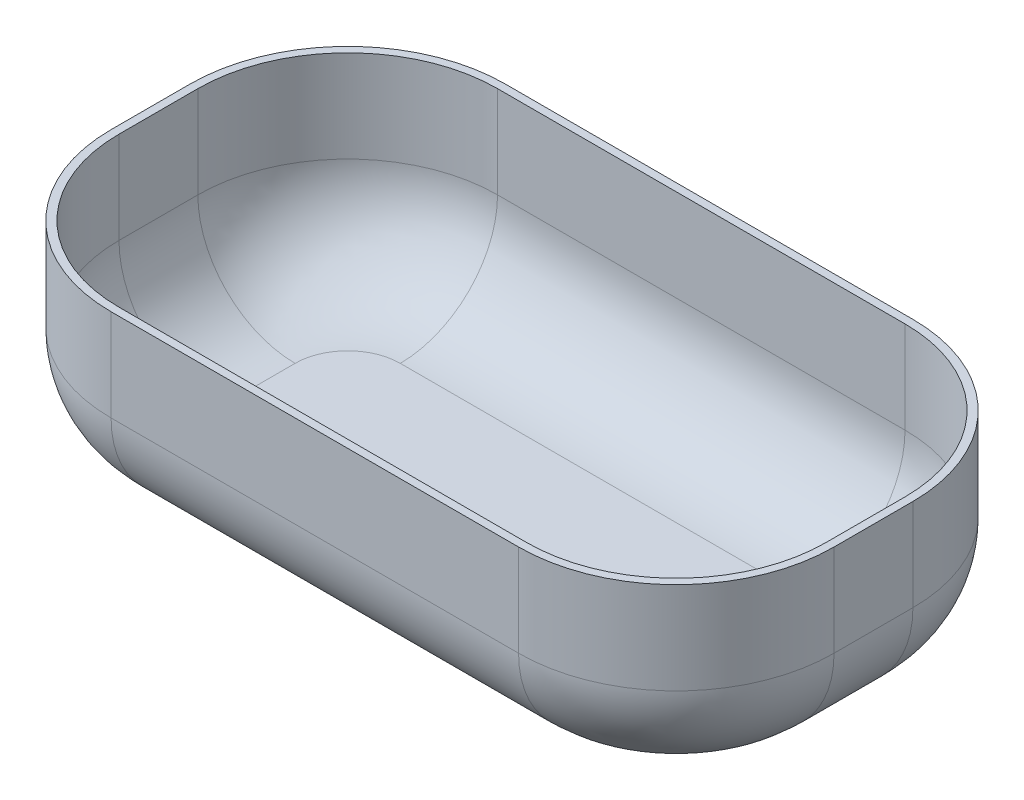
ISO-10303-21;
HEADER;
FILE_DESCRIPTION(('STEP AP214'),'2;1');
FILE_NAME('part.step','',(''),(''),'','','');
FILE_SCHEMA(('AUTOMOTIVE_DESIGN { 1 0 10303 214 1 1 1 1 }'));
ENDSEC;
DATA;
#1=APPLICATION_CONTEXT('core data for automotive mechanical design processes');
#2=APPLICATION_PROTOCOL_DEFINITION('international standard','automotive_design',2000,#1);
#3=PRODUCT_CONTEXT('',#1,'mechanical');
#4=PRODUCT('Part','Part','',(#3));
#5=PRODUCT_RELATED_PRODUCT_CATEGORY('part','',(#4));
#6=PRODUCT_DEFINITION_FORMATION('','',#4);
#7=PRODUCT_DEFINITION_CONTEXT('part definition',#1,'design');
#8=PRODUCT_DEFINITION('design','',#6,#7);
#9=PRODUCT_DEFINITION_SHAPE('','',#8);
#10=(LENGTH_UNIT() NAMED_UNIT(*) SI_UNIT(.MILLI.,.METRE.));
#11=(NAMED_UNIT(*) PLANE_ANGLE_UNIT() SI_UNIT($,.RADIAN.));
#12=(NAMED_UNIT(*) SI_UNIT($,.STERADIAN.) SOLID_ANGLE_UNIT());
#13=UNCERTAINTY_MEASURE_WITH_UNIT(LENGTH_MEASURE(1.E-05),#10,'distance_accuracy_value','');
#14=(GEOMETRIC_REPRESENTATION_CONTEXT(3) GLOBAL_UNCERTAINTY_ASSIGNED_CONTEXT((#13)) GLOBAL_UNIT_ASSIGNED_CONTEXT((#10,
#11,#12)) REPRESENTATION_CONTEXT('',''));
#15=CARTESIAN_POINT('',(0.,0.,0.));
#16=DIRECTION('',(0.,0.,1.));
#17=DIRECTION('',(1.,0.,0.));
#18=AXIS2_PLACEMENT_3D('',#15,#16,#17);
#19=CARTESIAN_POINT('',(-275.,0.,150.));
#20=DIRECTION('',(1.,0.,0.));
#21=DIRECTION('',(0.,0.,-1.));
#22=AXIS2_PLACEMENT_3D('',#19,#20,#21);
#23=PLANE('',#22);
#24=DIRECTION('',(0.,-1.,0.));
#25=VECTOR('',#24,1.);
#26=CARTESIAN_POINT('',(-275.,-150.,-30.));
#27=LINE('',#26,#25);
#28=CARTESIAN_POINT('',(-275.,0.,-30.));
#29=VERTEX_POINT('',#28);
#30=CARTESIAN_POINT('',(-275.,-70.,-30.));
#31=VERTEX_POINT('',#30);
#32=EDGE_CURVE('E311',#29,#31,#27,.T.);
#33=ORIENTED_EDGE('',*,*,#32,.T.);
#34=DIRECTION('',(0.,0.,-1.));
#35=VECTOR('',#34,1.);
#36=CARTESIAN_POINT('',(-275.,-70.,150.));
#37=LINE('',#36,#35);
#38=CARTESIAN_POINT('',(-275.,-70.,30.));
#39=VERTEX_POINT('',#38);
#40=EDGE_CURVE('E334',#31,#39,#37,.F.);
#41=ORIENTED_EDGE('',*,*,#40,.T.);
#42=DIRECTION('',(0.,-1.,0.));
#43=VECTOR('',#42,1.);
#44=CARTESIAN_POINT('',(-275.,0.,30.));
#45=LINE('',#44,#43);
#46=CARTESIAN_POINT('',(-275.,0.,30.));
#47=VERTEX_POINT('',#46);
#48=EDGE_CURVE('E309',#39,#47,#45,.F.);
#49=ORIENTED_EDGE('',*,*,#48,.T.);
#50=DIRECTION('',(0.,0.,-1.));
#51=VECTOR('',#50,1.);
#52=CARTESIAN_POINT('',(-275.,0.,150.));
#53=LINE('',#52,#51);
#54=EDGE_CURVE('E278',#47,#29,#53,.T.);
#55=ORIENTED_EDGE('',*,*,#54,.T.);
#56=EDGE_LOOP('',(#33,#41,#49,#55));
#57=FACE_BOUND('',#56,.T.);
#58=ADVANCED_FACE('F43',(#57),#23,.F.);
#59=CARTESIAN_POINT('',(275.,-150.,150.));
#60=DIRECTION('',(0.,1.,0.));
#61=DIRECTION('',(-1.,0.,0.));
#62=AXIS2_PLACEMENT_3D('',#59,#60,#61);
#63=PLANE('',#62);
#64=DIRECTION('',(0.,0.,-1.));
#65=VECTOR('',#64,1.);
#66=CARTESIAN_POINT('',(-195.,-150.,150.));
#67=LINE('',#66,#65);
#68=CARTESIAN_POINT('',(-195.,-150.,30.));
#69=VERTEX_POINT('',#68);
#70=CARTESIAN_POINT('',(-195.,-150.,-30.));
#71=VERTEX_POINT('',#70);
#72=EDGE_CURVE('E326',#69,#71,#67,.T.);
#73=ORIENTED_EDGE('',*,*,#72,.T.);
#74=CARTESIAN_POINT('',(-155.,-150.,-30.));
#75=DIRECTION('',(0.,1.,0.));
#76=DIRECTION('',(-1.,0.,0.));
#77=AXIS2_PLACEMENT_3D('',#74,#75,#76);
#78=CIRCLE('',#77,40.);
#79=CARTESIAN_POINT('',(-155.,-150.,-70.));
#80=VERTEX_POINT('',#79);
#81=EDGE_CURVE('E328',#71,#80,#78,.F.);
#82=ORIENTED_EDGE('',*,*,#81,.T.);
#83=DIRECTION('',(1.,0.,0.));
#84=VECTOR('',#83,1.);
#85=CARTESIAN_POINT('',(155.,-150.,-70.));
#86=LINE('',#85,#84);
#87=CARTESIAN_POINT('',(155.,-150.,-70.));
#88=VERTEX_POINT('',#87);
#89=EDGE_CURVE('E314',#80,#88,#86,.T.);
#90=ORIENTED_EDGE('',*,*,#89,.T.);
#91=CARTESIAN_POINT('',(155.,-150.,-30.));
#92=DIRECTION('',(0.,1.,0.));
#93=DIRECTION('',(-1.,0.,0.));
#94=AXIS2_PLACEMENT_3D('',#91,#92,#93);
#95=CIRCLE('',#94,40.);
#96=CARTESIAN_POINT('',(195.,-150.,-30.));
#97=VERTEX_POINT('',#96);
#98=EDGE_CURVE('E316',#88,#97,#95,.F.);
#99=ORIENTED_EDGE('',*,*,#98,.T.);
#100=DIRECTION('',(0.,0.,-1.));
#101=VECTOR('',#100,1.);
#102=CARTESIAN_POINT('',(195.,-150.,150.));
#103=LINE('',#102,#101);
#104=CARTESIAN_POINT('',(195.,-150.,30.));
#105=VERTEX_POINT('',#104);
#106=EDGE_CURVE('E318',#97,#105,#103,.F.);
#107=ORIENTED_EDGE('',*,*,#106,.T.);
#108=CARTESIAN_POINT('',(155.,-150.,30.));
#109=DIRECTION('',(0.,1.,0.));
#110=DIRECTION('',(-1.,0.,0.));
#111=AXIS2_PLACEMENT_3D('',#108,#109,#110);
#112=CIRCLE('',#111,40.);
#113=CARTESIAN_POINT('',(155.,-150.,70.));
#114=VERTEX_POINT('',#113);
#115=EDGE_CURVE('E320',#105,#114,#112,.F.);
#116=ORIENTED_EDGE('',*,*,#115,.T.);
#117=DIRECTION('',(1.,0.,0.));
#118=VECTOR('',#117,1.);
#119=CARTESIAN_POINT('',(275.,-150.,70.));
#120=LINE('',#119,#118);
#121=CARTESIAN_POINT('',(-155.,-150.,70.));
#122=VERTEX_POINT('',#121);
#123=EDGE_CURVE('E322',#114,#122,#120,.F.);
#124=ORIENTED_EDGE('',*,*,#123,.T.);
#125=CARTESIAN_POINT('',(-155.,-150.,30.));
#126=DIRECTION('',(0.,1.,0.));
#127=DIRECTION('',(-1.,0.,0.));
#128=AXIS2_PLACEMENT_3D('',#125,#126,#127);
#129=CIRCLE('',#128,40.);
#130=EDGE_CURVE('E324',#122,#69,#129,.F.);
#131=ORIENTED_EDGE('',*,*,#130,.T.);
#132=EDGE_LOOP('',(#73,#82,#90,#99,#107,#116,#124,#131));
#133=FACE_BOUND('',#132,.T.);
#134=ADVANCED_FACE('F410',(#133),#63,.F.);
#135=CARTESIAN_POINT('',(275.,0.,150.));
#136=DIRECTION('',(-1.,0.,0.));
#137=DIRECTION('',(0.,0.,1.));
#138=AXIS2_PLACEMENT_3D('',#135,#136,#137);
#139=PLANE('',#138);
#140=DIRECTION('',(0.,1.,0.));
#141=VECTOR('',#140,1.);
#142=CARTESIAN_POINT('',(275.,0.,30.));
#143=LINE('',#142,#141);
#144=CARTESIAN_POINT('',(275.,0.,30.));
#145=VERTEX_POINT('',#144);
#146=CARTESIAN_POINT('',(275.,-70.,30.));
#147=VERTEX_POINT('',#146);
#148=EDGE_CURVE('E287',#145,#147,#143,.F.);
#149=ORIENTED_EDGE('',*,*,#148,.T.);
#150=DIRECTION('',(0.,0.,-1.));
#151=VECTOR('',#150,1.);
#152=CARTESIAN_POINT('',(275.,-70.,150.));
#153=LINE('',#152,#151);
#154=CARTESIAN_POINT('',(275.,-70.,-30.));
#155=VERTEX_POINT('',#154);
#156=EDGE_CURVE('E342',#147,#155,#153,.T.);
#157=ORIENTED_EDGE('',*,*,#156,.T.);
#158=DIRECTION('',(0.,1.,0.));
#159=VECTOR('',#158,1.);
#160=CARTESIAN_POINT('',(275.,0.,-30.));
#161=LINE('',#160,#159);
#162=CARTESIAN_POINT('',(275.,0.,-30.));
#163=VERTEX_POINT('',#162);
#164=EDGE_CURVE('E290',#155,#163,#161,.T.);
#165=ORIENTED_EDGE('',*,*,#164,.T.);
#166=DIRECTION('',(0.,0.,-1.));
#167=VECTOR('',#166,1.);
#168=CARTESIAN_POINT('',(275.,0.,150.));
#169=LINE('',#168,#167);
#170=EDGE_CURVE('E284',#145,#163,#169,.T.);
#171=ORIENTED_EDGE('',*,*,#170,.F.);
#172=EDGE_LOOP('',(#149,#157,#165,#171));
#173=FACE_BOUND('',#172,.T.);
#174=ADVANCED_FACE('F384',(#173),#139,.F.);
#175=CARTESIAN_POINT('',(-275.,0.,150.));
#176=DIRECTION('',(0.,-1.,0.));
#177=DIRECTION('',(0.,0.,-1.));
#178=AXIS2_PLACEMENT_3D('',#175,#176,#177);
#179=PLANE('',#178);
#180=DIRECTION('',(0.,0.,-1.));
#181=VECTOR('',#180,1.);
#182=CARTESIAN_POINT('',(269.,0.,150.));
#183=LINE('',#182,#181);
#184=CARTESIAN_POINT('',(269.,0.,30.));
#185=VERTEX_POINT('',#184);
#186=CARTESIAN_POINT('',(269.,0.,-30.));
#187=VERTEX_POINT('',#186);
#188=EDGE_CURVE('E256',#185,#187,#183,.T.);
#189=ORIENTED_EDGE('',*,*,#188,.F.);
#190=CARTESIAN_POINT('',(155.,0.,30.));
#191=DIRECTION('',(0.,-1.,0.));
#192=DIRECTION('',(0.,0.,-1.));
#193=AXIS2_PLACEMENT_3D('',#190,#191,#192);
#194=CIRCLE('',#193,114.);
#195=CARTESIAN_POINT('',(155.,0.,144.));
#196=VERTEX_POINT('',#195);
#197=EDGE_CURVE('E263',#196,#185,#194,.F.);
#198=ORIENTED_EDGE('',*,*,#197,.F.);
#199=DIRECTION('',(-1.,0.,0.));
#200=VECTOR('',#199,1.);
#201=CARTESIAN_POINT('',(0.,0.,144.));
#202=LINE('',#201,#200);
#203=CARTESIAN_POINT('',(-155.,0.,144.));
#204=VERTEX_POINT('',#203);
#205=EDGE_CURVE('E60',#196,#204,#202,.T.);
#206=ORIENTED_EDGE('',*,*,#205,.T.);
#207=CARTESIAN_POINT('',(-155.,0.,30.));
#208=DIRECTION('',(0.,-1.,0.));
#209=DIRECTION('',(0.,0.,-1.));
#210=AXIS2_PLACEMENT_3D('',#207,#208,#209);
#211=CIRCLE('',#210,114.);
#212=CARTESIAN_POINT('',(-269.,0.,30.));
#213=VERTEX_POINT('',#212);
#214=EDGE_CURVE('E257',#213,#204,#211,.F.);
#215=ORIENTED_EDGE('',*,*,#214,.F.);
#216=DIRECTION('',(0.,0.,-1.));
#217=VECTOR('',#216,1.);
#218=CARTESIAN_POINT('',(-269.,0.,150.));
#219=LINE('',#218,#217);
#220=CARTESIAN_POINT('',(-269.,0.,-30.));
#221=VERTEX_POINT('',#220);
#222=EDGE_CURVE('E227',#213,#221,#219,.T.);
#223=ORIENTED_EDGE('',*,*,#222,.T.);
#224=CARTESIAN_POINT('',(-155.,0.,-30.));
#225=DIRECTION('',(0.,-1.,0.));
#226=DIRECTION('',(0.,0.,-1.));
#227=AXIS2_PLACEMENT_3D('',#224,#225,#226);
#228=CIRCLE('',#227,114.);
#229=CARTESIAN_POINT('',(-155.,0.,-144.));
#230=VERTEX_POINT('',#229);
#231=EDGE_CURVE('E259',#230,#221,#228,.F.);
#232=ORIENTED_EDGE('',*,*,#231,.F.);
#233=DIRECTION('',(-1.,0.,0.));
#234=VECTOR('',#233,1.);
#235=CARTESIAN_POINT('',(0.,0.,-144.));
#236=LINE('',#235,#234);
#237=CARTESIAN_POINT('',(155.,0.,-144.));
#238=VERTEX_POINT('',#237);
#239=EDGE_CURVE('E262',#238,#230,#236,.T.);
#240=ORIENTED_EDGE('',*,*,#239,.F.);
#241=CARTESIAN_POINT('',(155.,0.,-30.));
#242=DIRECTION('',(0.,-1.,0.));
#243=DIRECTION('',(0.,0.,-1.));
#244=AXIS2_PLACEMENT_3D('',#241,#242,#243);
#245=CIRCLE('',#244,114.);
#246=EDGE_CURVE('E265',#187,#238,#245,.F.);
#247=ORIENTED_EDGE('',*,*,#246,.F.);
#248=EDGE_LOOP('',(#189,#198,#206,#215,#223,#232,#240,#247));
#249=FACE_BOUND('',#248,.T.);
#250=ORIENTED_EDGE('',*,*,#170,.T.);
#251=CARTESIAN_POINT('',(155.,0.,-30.));
#252=DIRECTION('',(0.,-1.,0.));
#253=DIRECTION('',(0.,0.,-1.));
#254=AXIS2_PLACEMENT_3D('',#251,#252,#253);
#255=CIRCLE('',#254,120.);
#256=CARTESIAN_POINT('',(155.,0.,-150.));
#257=VERTEX_POINT('',#256);
#258=EDGE_CURVE('E298',#163,#257,#255,.F.);
#259=ORIENTED_EDGE('',*,*,#258,.T.);
#260=DIRECTION('',(-1.,0.,0.));
#261=VECTOR('',#260,1.);
#262=CARTESIAN_POINT('',(-275.,0.,-150.));
#263=LINE('',#262,#261);
#264=CARTESIAN_POINT('',(-155.,0.,-150.));
#265=VERTEX_POINT('',#264);
#266=EDGE_CURVE('E279',#257,#265,#263,.T.);
#267=ORIENTED_EDGE('',*,*,#266,.T.);
#268=CARTESIAN_POINT('',(-155.,0.,-30.));
#269=DIRECTION('',(0.,-1.,0.));
#270=DIRECTION('',(0.,0.,-1.));
#271=AXIS2_PLACEMENT_3D('',#268,#269,#270);
#272=CIRCLE('',#271,120.);
#273=EDGE_CURVE('E294',#265,#29,#272,.F.);
#274=ORIENTED_EDGE('',*,*,#273,.T.);
#275=ORIENTED_EDGE('',*,*,#54,.F.);
#276=CARTESIAN_POINT('',(-155.,0.,30.));
#277=DIRECTION('',(0.,-1.,0.));
#278=DIRECTION('',(0.,0.,-1.));
#279=AXIS2_PLACEMENT_3D('',#276,#277,#278);
#280=CIRCLE('',#279,120.);
#281=CARTESIAN_POINT('',(-155.,0.,150.));
#282=VERTEX_POINT('',#281);
#283=EDGE_CURVE('E292',#47,#282,#280,.F.);
#284=ORIENTED_EDGE('',*,*,#283,.T.);
#285=DIRECTION('',(-1.,0.,0.));
#286=VECTOR('',#285,1.);
#287=CARTESIAN_POINT('',(-275.,0.,150.));
#288=LINE('',#287,#286);
#289=CARTESIAN_POINT('',(155.,0.,150.));
#290=VERTEX_POINT('',#289);
#291=EDGE_CURVE('E275',#290,#282,#288,.T.);
#292=ORIENTED_EDGE('',*,*,#291,.F.);
#293=CARTESIAN_POINT('',(155.,0.,30.));
#294=DIRECTION('',(0.,-1.,0.));
#295=DIRECTION('',(0.,0.,-1.));
#296=AXIS2_PLACEMENT_3D('',#293,#294,#295);
#297=CIRCLE('',#296,120.);
#298=EDGE_CURVE('E296',#290,#145,#297,.F.);
#299=ORIENTED_EDGE('',*,*,#298,.T.);
#300=EDGE_LOOP('',(#250,#259,#267,#274,#275,#284,#292,#299));
#301=FACE_BOUND('',#300,.T.);
#302=ADVANCED_FACE('F387',(#249,#301),#179,.F.);
#303=CARTESIAN_POINT('',(0.,0.,150.));
#304=DIRECTION('',(0.,0.,-1.));
#305=DIRECTION('',(-1.,0.,0.));
#306=AXIS2_PLACEMENT_3D('',#303,#304,#305);
#307=PLANE('',#306);
#308=DIRECTION('',(0.,-1.,0.));
#309=VECTOR('',#308,1.);
#310=CARTESIAN_POINT('',(-155.,0.,150.));
#311=LINE('',#310,#309);
#312=CARTESIAN_POINT('',(-155.,-70.,150.));
#313=VERTEX_POINT('',#312);
#314=EDGE_CURVE('E304',#282,#313,#311,.T.);
#315=ORIENTED_EDGE('',*,*,#314,.T.);
#316=DIRECTION('',(1.,0.,0.));
#317=VECTOR('',#316,1.);
#318=CARTESIAN_POINT('',(0.,-70.,150.));
#319=LINE('',#318,#317);
#320=CARTESIAN_POINT('',(155.,-70.,150.));
#321=VERTEX_POINT('',#320);
#322=EDGE_CURVE('E338',#313,#321,#319,.T.);
#323=ORIENTED_EDGE('',*,*,#322,.T.);
#324=DIRECTION('',(0.,1.,0.));
#325=VECTOR('',#324,1.);
#326=CARTESIAN_POINT('',(155.,0.,150.));
#327=LINE('',#326,#325);
#328=EDGE_CURVE('E307',#321,#290,#327,.T.);
#329=ORIENTED_EDGE('',*,*,#328,.T.);
#330=ORIENTED_EDGE('',*,*,#291,.T.);
#331=EDGE_LOOP('',(#315,#323,#329,#330));
#332=FACE_BOUND('',#331,.T.);
#333=ADVANCED_FACE('F394',(#332),#307,.F.);
#334=CARTESIAN_POINT('',(0.,0.,-150.));
#335=DIRECTION('',(0.,0.,-1.));
#336=DIRECTION('',(-1.,0.,0.));
#337=AXIS2_PLACEMENT_3D('',#334,#335,#336);
#338=PLANE('',#337);
#339=DIRECTION('',(0.,1.,0.));
#340=VECTOR('',#339,1.);
#341=CARTESIAN_POINT('',(155.,-150.,-150.));
#342=LINE('',#341,#340);
#343=CARTESIAN_POINT('',(155.,-70.,-150.));
#344=VERTEX_POINT('',#343);
#345=EDGE_CURVE('E302',#257,#344,#342,.F.);
#346=ORIENTED_EDGE('',*,*,#345,.T.);
#347=DIRECTION('',(1.,0.,0.));
#348=VECTOR('',#347,1.);
#349=CARTESIAN_POINT('',(-155.,-70.,-150.));
#350=LINE('',#349,#348);
#351=CARTESIAN_POINT('',(-155.,-70.,-150.));
#352=VERTEX_POINT('',#351);
#353=EDGE_CURVE('E11',#344,#352,#350,.F.);
#354=ORIENTED_EDGE('',*,*,#353,.T.);
#355=DIRECTION('',(0.,-1.,0.));
#356=VECTOR('',#355,1.);
#357=CARTESIAN_POINT('',(-155.,0.,-150.));
#358=LINE('',#357,#356);
#359=EDGE_CURVE('E300',#352,#265,#358,.F.);
#360=ORIENTED_EDGE('',*,*,#359,.T.);
#361=ORIENTED_EDGE('',*,*,#266,.F.);
#362=EDGE_LOOP('',(#346,#354,#360,#361));
#363=FACE_BOUND('',#362,.T.);
#364=ADVANCED_FACE('F424',(#363),#338,.T.);
#365=CARTESIAN_POINT('',(155.,0.,-30.));
#366=DIRECTION('',(0.,-1.,0.));
#367=DIRECTION('',(0.,0.,-1.));
#368=AXIS2_PLACEMENT_3D('',#365,#366,#367);
#369=CYLINDRICAL_SURFACE('',#368,120.);
#370=ORIENTED_EDGE('',*,*,#164,.F.);
#371=CARTESIAN_POINT('',(155.,-70.,-30.));
#372=DIRECTION('',(0.,1.,0.));
#373=DIRECTION('',(-1.,0.,0.));
#374=AXIS2_PLACEMENT_3D('',#371,#372,#373);
#375=CIRCLE('',#374,120.);
#376=EDGE_CURVE('E52',#155,#344,#375,.T.);
#377=ORIENTED_EDGE('',*,*,#376,.T.);
#378=ORIENTED_EDGE('',*,*,#345,.F.);
#379=ORIENTED_EDGE('',*,*,#258,.F.);
#380=EDGE_LOOP('',(#370,#377,#378,#379));
#381=FACE_BOUND('',#380,.T.);
#382=ADVANCED_FACE('F451',(#381),#369,.T.);
#383=CARTESIAN_POINT('',(155.,0.,30.));
#384=DIRECTION('',(0.,1.,0.));
#385=DIRECTION('',(0.,0.,1.));
#386=AXIS2_PLACEMENT_3D('',#383,#384,#385);
#387=CYLINDRICAL_SURFACE('',#386,120.);
#388=ORIENTED_EDGE('',*,*,#328,.F.);
#389=CARTESIAN_POINT('',(155.,-70.,30.));
#390=DIRECTION('',(0.,1.,0.));
#391=DIRECTION('',(-1.,0.,0.));
#392=AXIS2_PLACEMENT_3D('',#389,#390,#391);
#393=CIRCLE('',#392,120.);
#394=EDGE_CURVE('E340',#321,#147,#393,.T.);
#395=ORIENTED_EDGE('',*,*,#394,.T.);
#396=ORIENTED_EDGE('',*,*,#148,.F.);
#397=ORIENTED_EDGE('',*,*,#298,.F.);
#398=EDGE_LOOP('',(#388,#395,#396,#397));
#399=FACE_BOUND('',#398,.T.);
#400=ADVANCED_FACE('F380',(#399),#387,.T.);
#401=CARTESIAN_POINT('',(-155.,0.,-30.));
#402=DIRECTION('',(0.,1.,0.));
#403=DIRECTION('',(0.,0.,1.));
#404=AXIS2_PLACEMENT_3D('',#401,#402,#403);
#405=CYLINDRICAL_SURFACE('',#404,120.);
#406=ORIENTED_EDGE('',*,*,#359,.F.);
#407=CARTESIAN_POINT('',(-155.,-70.,-30.));
#408=DIRECTION('',(0.,1.,0.));
#409=DIRECTION('',(-1.,0.,0.));
#410=AXIS2_PLACEMENT_3D('',#407,#408,#409);
#411=CIRCLE('',#410,120.);
#412=EDGE_CURVE('E331',#352,#31,#411,.T.);
#413=ORIENTED_EDGE('',*,*,#412,.T.);
#414=ORIENTED_EDGE('',*,*,#32,.F.);
#415=ORIENTED_EDGE('',*,*,#273,.F.);
#416=EDGE_LOOP('',(#406,#413,#414,#415));
#417=FACE_BOUND('',#416,.T.);
#418=ADVANCED_FACE('F428',(#417),#405,.T.);
#419=CARTESIAN_POINT('',(-155.,0.,30.));
#420=DIRECTION('',(0.,-1.,0.));
#421=DIRECTION('',(0.,0.,-1.));
#422=AXIS2_PLACEMENT_3D('',#419,#420,#421);
#423=CYLINDRICAL_SURFACE('',#422,120.);
#424=ORIENTED_EDGE('',*,*,#48,.F.);
#425=CARTESIAN_POINT('',(-155.,-70.,30.));
#426=DIRECTION('',(0.,1.,0.));
#427=DIRECTION('',(-1.,0.,0.));
#428=AXIS2_PLACEMENT_3D('',#425,#426,#427);
#429=CIRCLE('',#428,120.);
#430=EDGE_CURVE('E336',#39,#313,#429,.T.);
#431=ORIENTED_EDGE('',*,*,#430,.T.);
#432=ORIENTED_EDGE('',*,*,#314,.F.);
#433=ORIENTED_EDGE('',*,*,#283,.F.);
#434=EDGE_LOOP('',(#424,#431,#432,#433));
#435=FACE_BOUND('',#434,.T.);
#436=ADVANCED_FACE('F397',(#435),#423,.T.);
#437=CARTESIAN_POINT('',(155.,-70.,30.));
#438=DIRECTION('',(0.,1.,0.));
#439=DIRECTION('',(-1.,0.,0.));
#440=AXIS2_PLACEMENT_3D('',#437,#438,#439);
#441=DEGENERATE_TOROIDAL_SURFACE('',#440,40.,80.,.T.);
#442=CARTESIAN_POINT('',(195.,-70.,30.));
#443=DIRECTION('',(0.,0.,-1.));
#444=DIRECTION('',(-1.,0.,0.));
#445=AXIS2_PLACEMENT_3D('',#442,#443,#444);
#446=CIRCLE('',#445,80.);
#447=EDGE_CURVE('E361',#147,#105,#446,.T.);
#448=ORIENTED_EDGE('',*,*,#447,.F.);
#449=ORIENTED_EDGE('',*,*,#394,.F.);
#450=CARTESIAN_POINT('',(155.,-70.,70.));
#451=DIRECTION('',(-1.,0.,0.));
#452=DIRECTION('',(0.,0.,1.));
#453=AXIS2_PLACEMENT_3D('',#450,#451,#452);
#454=CIRCLE('',#453,80.);
#455=EDGE_CURVE('E47',#114,#321,#454,.T.);
#456=ORIENTED_EDGE('',*,*,#455,.F.);
#457=ORIENTED_EDGE('',*,*,#115,.F.);
#458=EDGE_LOOP('',(#448,#449,#456,#457));
#459=FACE_BOUND('',#458,.T.);
#460=ADVANCED_FACE('F45',(#459),#441,.T.);
#461=CARTESIAN_POINT('',(0.,-70.,70.));
#462=DIRECTION('',(1.,0.,0.));
#463=DIRECTION('',(0.,1.,0.));
#464=AXIS2_PLACEMENT_3D('',#461,#462,#463);
#465=CYLINDRICAL_SURFACE('',#464,80.);
#466=ORIENTED_EDGE('',*,*,#455,.T.);
#467=ORIENTED_EDGE('',*,*,#322,.F.);
#468=CARTESIAN_POINT('',(-155.,-70.,70.));
#469=DIRECTION('',(-1.,0.,0.));
#470=DIRECTION('',(0.,0.,1.));
#471=AXIS2_PLACEMENT_3D('',#468,#469,#470);
#472=CIRCLE('',#471,80.);
#473=EDGE_CURVE('E359',#122,#313,#472,.T.);
#474=ORIENTED_EDGE('',*,*,#473,.F.);
#475=ORIENTED_EDGE('',*,*,#123,.F.);
#476=EDGE_LOOP('',(#466,#467,#474,#475));
#477=FACE_BOUND('',#476,.T.);
#478=ADVANCED_FACE('F372',(#477),#465,.T.);
#479=CARTESIAN_POINT('',(195.,-70.,150.));
#480=DIRECTION('',(0.,0.,-1.));
#481=DIRECTION('',(-1.,0.,0.));
#482=AXIS2_PLACEMENT_3D('',#479,#480,#481);
#483=CYLINDRICAL_SURFACE('',#482,80.);
#484=ORIENTED_EDGE('',*,*,#447,.T.);
#485=ORIENTED_EDGE('',*,*,#106,.F.);
#486=CARTESIAN_POINT('',(195.,-70.,-30.));
#487=DIRECTION('',(0.,0.,-1.));
#488=DIRECTION('',(-1.,0.,0.));
#489=AXIS2_PLACEMENT_3D('',#486,#487,#488);
#490=CIRCLE('',#489,80.);
#491=EDGE_CURVE('E356',#155,#97,#490,.T.);
#492=ORIENTED_EDGE('',*,*,#491,.F.);
#493=ORIENTED_EDGE('',*,*,#156,.F.);
#494=EDGE_LOOP('',(#484,#485,#492,#493));
#495=FACE_BOUND('',#494,.T.);
#496=ADVANCED_FACE('F413',(#495),#483,.T.);
#497=CARTESIAN_POINT('',(-155.,-70.,30.));
#498=DIRECTION('',(0.,1.,0.));
#499=DIRECTION('',(-1.,0.,0.));
#500=AXIS2_PLACEMENT_3D('',#497,#498,#499);
#501=DEGENERATE_TOROIDAL_SURFACE('',#500,40.,80.,.T.);
#502=ORIENTED_EDGE('',*,*,#473,.T.);
#503=ORIENTED_EDGE('',*,*,#430,.F.);
#504=CARTESIAN_POINT('',(-195.,-70.,30.));
#505=DIRECTION('',(0.,0.,-1.));
#506=DIRECTION('',(-1.,0.,0.));
#507=AXIS2_PLACEMENT_3D('',#504,#505,#506);
#508=CIRCLE('',#507,80.);
#509=EDGE_CURVE('E353',#69,#39,#508,.T.);
#510=ORIENTED_EDGE('',*,*,#509,.F.);
#511=ORIENTED_EDGE('',*,*,#130,.F.);
#512=EDGE_LOOP('',(#502,#503,#510,#511));
#513=FACE_BOUND('',#512,.T.);
#514=ADVANCED_FACE('F401',(#513),#501,.T.);
#515=CARTESIAN_POINT('',(155.,-70.,-30.));
#516=DIRECTION('',(0.,1.,0.));
#517=DIRECTION('',(-1.,0.,0.));
#518=AXIS2_PLACEMENT_3D('',#515,#516,#517);
#519=DEGENERATE_TOROIDAL_SURFACE('',#518,40.,80.,.T.);
#520=ORIENTED_EDGE('',*,*,#491,.T.);
#521=ORIENTED_EDGE('',*,*,#98,.F.);
#522=CARTESIAN_POINT('',(155.,-70.,-70.));
#523=DIRECTION('',(-1.,0.,0.));
#524=DIRECTION('',(0.,0.,1.));
#525=AXIS2_PLACEMENT_3D('',#522,#523,#524);
#526=CIRCLE('',#525,80.);
#527=EDGE_CURVE('E350',#344,#88,#526,.T.);
#528=ORIENTED_EDGE('',*,*,#527,.F.);
#529=ORIENTED_EDGE('',*,*,#376,.F.);
#530=EDGE_LOOP('',(#520,#521,#528,#529));
#531=FACE_BOUND('',#530,.T.);
#532=ADVANCED_FACE('F415',(#531),#519,.T.);
#533=CARTESIAN_POINT('',(-195.,-70.,150.));
#534=DIRECTION('',(0.,0.,-1.));
#535=DIRECTION('',(-1.,0.,0.));
#536=AXIS2_PLACEMENT_3D('',#533,#534,#535);
#537=CYLINDRICAL_SURFACE('',#536,80.);
#538=ORIENTED_EDGE('',*,*,#509,.T.);
#539=ORIENTED_EDGE('',*,*,#40,.F.);
#540=CARTESIAN_POINT('',(-195.,-70.,-30.));
#541=DIRECTION('',(0.,0.,-1.));
#542=DIRECTION('',(-1.,0.,0.));
#543=AXIS2_PLACEMENT_3D('',#540,#541,#542);
#544=CIRCLE('',#543,80.);
#545=EDGE_CURVE('E347',#71,#31,#544,.T.);
#546=ORIENTED_EDGE('',*,*,#545,.F.);
#547=ORIENTED_EDGE('',*,*,#72,.F.);
#548=EDGE_LOOP('',(#538,#539,#546,#547));
#549=FACE_BOUND('',#548,.T.);
#550=ADVANCED_FACE('F406',(#549),#537,.T.);
#551=CARTESIAN_POINT('',(275.,-70.,-70.));
#552=DIRECTION('',(-1.,0.,0.));
#553=DIRECTION('',(0.,-1.,0.));
#554=AXIS2_PLACEMENT_3D('',#551,#552,#553);
#555=CYLINDRICAL_SURFACE('',#554,80.);
#556=ORIENTED_EDGE('',*,*,#527,.T.);
#557=ORIENTED_EDGE('',*,*,#89,.F.);
#558=CARTESIAN_POINT('',(-155.,-70.,-70.));
#559=DIRECTION('',(-1.,0.,0.));
#560=DIRECTION('',(0.,0.,1.));
#561=AXIS2_PLACEMENT_3D('',#558,#559,#560);
#562=CIRCLE('',#561,80.);
#563=EDGE_CURVE('E345',#352,#80,#562,.T.);
#564=ORIENTED_EDGE('',*,*,#563,.F.);
#565=ORIENTED_EDGE('',*,*,#353,.F.);
#566=EDGE_LOOP('',(#556,#557,#564,#565));
#567=FACE_BOUND('',#566,.T.);
#568=ADVANCED_FACE('F421',(#567),#555,.T.);
#569=CARTESIAN_POINT('',(-155.,-70.,-30.));
#570=DIRECTION('',(0.,1.,0.));
#571=DIRECTION('',(-1.,0.,0.));
#572=AXIS2_PLACEMENT_3D('',#569,#570,#571);
#573=DEGENERATE_TOROIDAL_SURFACE('',#572,40.,80.,.T.);
#574=ORIENTED_EDGE('',*,*,#545,.T.);
#575=ORIENTED_EDGE('',*,*,#412,.F.);
#576=ORIENTED_EDGE('',*,*,#563,.T.);
#577=ORIENTED_EDGE('',*,*,#81,.F.);
#578=EDGE_LOOP('',(#574,#575,#576,#577));
#579=FACE_BOUND('',#578,.T.);
#580=ADVANCED_FACE('F431',(#579),#573,.T.);
#581=CARTESIAN_POINT('',(-269.,0.,150.));
#582=DIRECTION('',(1.,0.,0.));
#583=DIRECTION('',(0.,0.,-1.));
#584=AXIS2_PLACEMENT_3D('',#581,#582,#583);
#585=PLANE('',#584);
#586=DIRECTION('',(0.,1.,0.));
#587=VECTOR('',#586,1.);
#588=CARTESIAN_POINT('',(-269.,0.,-30.));
#589=LINE('',#588,#587);
#590=CARTESIAN_POINT('',(-269.,-70.,-30.));
#591=VERTEX_POINT('',#590);
#592=EDGE_CURVE('E230',#221,#591,#589,.F.);
#593=ORIENTED_EDGE('',*,*,#592,.F.);
#594=ORIENTED_EDGE('',*,*,#222,.F.);
#595=DIRECTION('',(0.,1.,0.));
#596=VECTOR('',#595,1.);
#597=CARTESIAN_POINT('',(-269.,0.,30.));
#598=LINE('',#597,#596);
#599=CARTESIAN_POINT('',(-269.,-70.,30.));
#600=VERTEX_POINT('',#599);
#601=EDGE_CURVE('E223',#600,#213,#598,.T.);
#602=ORIENTED_EDGE('',*,*,#601,.F.);
#603=DIRECTION('',(0.,0.,-1.));
#604=VECTOR('',#603,1.);
#605=CARTESIAN_POINT('',(-269.,-70.,150.));
#606=LINE('',#605,#604);
#607=EDGE_CURVE('E208',#591,#600,#606,.F.);
#608=ORIENTED_EDGE('',*,*,#607,.F.);
#609=EDGE_LOOP('',(#593,#594,#602,#608));
#610=FACE_BOUND('',#609,.T.);
#611=ADVANCED_FACE('F225',(#610),#585,.T.);
#612=CARTESIAN_POINT('',(275.,-144.,150.));
#613=DIRECTION('',(0.,1.,0.));
#614=DIRECTION('',(-1.,0.,0.));
#615=AXIS2_PLACEMENT_3D('',#612,#613,#614);
#616=PLANE('',#615);
#617=DIRECTION('',(0.,0.,1.));
#618=VECTOR('',#617,1.);
#619=CARTESIAN_POINT('',(-195.,-144.,150.));
#620=LINE('',#619,#618);
#621=CARTESIAN_POINT('',(-195.,-144.,30.));
#622=VERTEX_POINT('',#621);
#623=CARTESIAN_POINT('',(-195.,-144.,-30.));
#624=VERTEX_POINT('',#623);
#625=EDGE_CURVE('E797',#622,#624,#620,.F.);
#626=ORIENTED_EDGE('',*,*,#625,.F.);
#627=CARTESIAN_POINT('',(-155.,-144.,30.));
#628=DIRECTION('',(0.,1.,0.));
#629=DIRECTION('',(-1.,0.,0.));
#630=AXIS2_PLACEMENT_3D('',#627,#628,#629);
#631=CIRCLE('',#630,40.);
#632=CARTESIAN_POINT('',(-155.,-144.,70.));
#633=VERTEX_POINT('',#632);
#634=EDGE_CURVE('E243',#633,#622,#631,.F.);
#635=ORIENTED_EDGE('',*,*,#634,.F.);
#636=DIRECTION('',(-1.,0.,0.));
#637=VECTOR('',#636,1.);
#638=CARTESIAN_POINT('',(275.,-144.,70.));
#639=LINE('',#638,#637);
#640=CARTESIAN_POINT('',(155.,-144.,70.));
#641=VERTEX_POINT('',#640);
#642=EDGE_CURVE('E794',#641,#633,#639,.T.);
#643=ORIENTED_EDGE('',*,*,#642,.F.);
#644=CARTESIAN_POINT('',(155.,-144.,30.));
#645=DIRECTION('',(0.,1.,0.));
#646=DIRECTION('',(-1.,0.,0.));
#647=AXIS2_PLACEMENT_3D('',#644,#645,#646);
#648=CIRCLE('',#647,40.);
#649=CARTESIAN_POINT('',(195.,-144.,30.));
#650=VERTEX_POINT('',#649);
#651=EDGE_CURVE('E796',#650,#641,#648,.F.);
#652=ORIENTED_EDGE('',*,*,#651,.F.);
#653=DIRECTION('',(0.,0.,1.));
#654=VECTOR('',#653,1.);
#655=CARTESIAN_POINT('',(195.,-144.,150.));
#656=LINE('',#655,#654);
#657=CARTESIAN_POINT('',(195.,-144.,-30.));
#658=VERTEX_POINT('',#657);
#659=EDGE_CURVE('E806',#658,#650,#656,.T.);
#660=ORIENTED_EDGE('',*,*,#659,.F.);
#661=CARTESIAN_POINT('',(155.,-144.,-30.));
#662=DIRECTION('',(0.,1.,0.));
#663=DIRECTION('',(-1.,0.,0.));
#664=AXIS2_PLACEMENT_3D('',#661,#662,#663);
#665=CIRCLE('',#664,40.);
#666=CARTESIAN_POINT('',(155.,-144.,-70.));
#667=VERTEX_POINT('',#666);
#668=EDGE_CURVE('E804',#667,#658,#665,.F.);
#669=ORIENTED_EDGE('',*,*,#668,.F.);
#670=DIRECTION('',(-1.,0.,0.));
#671=VECTOR('',#670,1.);
#672=CARTESIAN_POINT('',(275.,-144.,-70.));
#673=LINE('',#672,#671);
#674=CARTESIAN_POINT('',(-155.,-144.,-70.));
#675=VERTEX_POINT('',#674);
#676=EDGE_CURVE('E802',#675,#667,#673,.F.);
#677=ORIENTED_EDGE('',*,*,#676,.F.);
#678=CARTESIAN_POINT('',(-155.,-144.,-30.));
#679=DIRECTION('',(0.,1.,0.));
#680=DIRECTION('',(-1.,0.,0.));
#681=AXIS2_PLACEMENT_3D('',#678,#679,#680);
#682=CIRCLE('',#681,40.);
#683=EDGE_CURVE('E799',#624,#675,#682,.F.);
#684=ORIENTED_EDGE('',*,*,#683,.F.);
#685=EDGE_LOOP('',(#626,#635,#643,#652,#660,#669,#677,#684));
#686=FACE_BOUND('',#685,.T.);
#687=ADVANCED_FACE('F438',(#686),#616,.T.);
#688=CARTESIAN_POINT('',(269.,0.,150.));
#689=DIRECTION('',(-1.,0.,0.));
#690=DIRECTION('',(0.,0.,1.));
#691=AXIS2_PLACEMENT_3D('',#688,#689,#690);
#692=PLANE('',#691);
#693=DIRECTION('',(0.,1.,0.));
#694=VECTOR('',#693,1.);
#695=CARTESIAN_POINT('',(269.,0.,30.));
#696=LINE('',#695,#694);
#697=CARTESIAN_POINT('',(269.,-70.,30.));
#698=VERTEX_POINT('',#697);
#699=EDGE_CURVE('E268',#185,#698,#696,.F.);
#700=ORIENTED_EDGE('',*,*,#699,.F.);
#701=ORIENTED_EDGE('',*,*,#188,.T.);
#702=DIRECTION('',(0.,1.,0.));
#703=VECTOR('',#702,1.);
#704=CARTESIAN_POINT('',(269.,0.,-30.));
#705=LINE('',#704,#703);
#706=CARTESIAN_POINT('',(269.,-70.,-30.));
#707=VERTEX_POINT('',#706);
#708=EDGE_CURVE('E260',#707,#187,#705,.T.);
#709=ORIENTED_EDGE('',*,*,#708,.F.);
#710=DIRECTION('',(0.,0.,1.));
#711=VECTOR('',#710,1.);
#712=CARTESIAN_POINT('',(269.,-70.,150.));
#713=LINE('',#712,#711);
#714=EDGE_CURVE('E774',#698,#707,#713,.F.);
#715=ORIENTED_EDGE('',*,*,#714,.F.);
#716=EDGE_LOOP('',(#700,#701,#709,#715));
#717=FACE_BOUND('',#716,.T.);
#718=ADVANCED_FACE('F543',(#717),#692,.T.);
#719=CARTESIAN_POINT('',(0.,0.,144.));
#720=DIRECTION('',(0.,0.,-1.));
#721=DIRECTION('',(-1.,0.,0.));
#722=AXIS2_PLACEMENT_3D('',#719,#720,#721);
#723=PLANE('',#722);
#724=DIRECTION('',(0.,1.,0.));
#725=VECTOR('',#724,1.);
#726=CARTESIAN_POINT('',(-155.,0.,144.));
#727=LINE('',#726,#725);
#728=CARTESIAN_POINT('',(-155.,-70.,144.));
#729=VERTEX_POINT('',#728);
#730=EDGE_CURVE('E235',#204,#729,#727,.F.);
#731=ORIENTED_EDGE('',*,*,#730,.F.);
#732=ORIENTED_EDGE('',*,*,#205,.F.);
#733=DIRECTION('',(0.,1.,0.));
#734=VECTOR('',#733,1.);
#735=CARTESIAN_POINT('',(155.,0.,144.));
#736=LINE('',#735,#734);
#737=CARTESIAN_POINT('',(155.,-70.,144.));
#738=VERTEX_POINT('',#737);
#739=EDGE_CURVE('E231',#738,#196,#736,.T.);
#740=ORIENTED_EDGE('',*,*,#739,.F.);
#741=DIRECTION('',(-1.,0.,0.));
#742=VECTOR('',#741,1.);
#743=CARTESIAN_POINT('',(0.,-70.,144.));
#744=LINE('',#743,#742);
#745=EDGE_CURVE('E239',#729,#738,#744,.F.);
#746=ORIENTED_EDGE('',*,*,#745,.F.);
#747=EDGE_LOOP('',(#731,#732,#740,#746));
#748=FACE_BOUND('',#747,.T.);
#749=ADVANCED_FACE('F553',(#748),#723,.T.);
#750=CARTESIAN_POINT('',(0.,0.,-144.));
#751=DIRECTION('',(0.,0.,-1.));
#752=DIRECTION('',(-1.,0.,0.));
#753=AXIS2_PLACEMENT_3D('',#750,#751,#752);
#754=PLANE('',#753);
#755=DIRECTION('',(0.,1.,0.));
#756=VECTOR('',#755,1.);
#757=CARTESIAN_POINT('',(155.,0.,-144.));
#758=LINE('',#757,#756);
#759=CARTESIAN_POINT('',(155.,-70.,-144.));
#760=VERTEX_POINT('',#759);
#761=EDGE_CURVE('E787',#238,#760,#758,.F.);
#762=ORIENTED_EDGE('',*,*,#761,.F.);
#763=ORIENTED_EDGE('',*,*,#239,.T.);
#764=DIRECTION('',(0.,1.,0.));
#765=VECTOR('',#764,1.);
#766=CARTESIAN_POINT('',(-155.,0.,-144.));
#767=LINE('',#766,#765);
#768=CARTESIAN_POINT('',(-155.,-70.,-144.));
#769=VERTEX_POINT('',#768);
#770=EDGE_CURVE('E270',#769,#230,#767,.T.);
#771=ORIENTED_EDGE('',*,*,#770,.F.);
#772=DIRECTION('',(-1.,0.,0.));
#773=VECTOR('',#772,1.);
#774=CARTESIAN_POINT('',(0.,-70.,-144.));
#775=LINE('',#774,#773);
#776=EDGE_CURVE('E348',#760,#769,#775,.T.);
#777=ORIENTED_EDGE('',*,*,#776,.F.);
#778=EDGE_LOOP('',(#762,#763,#771,#777));
#779=FACE_BOUND('',#778,.T.);
#780=ADVANCED_FACE('F562',(#779),#754,.F.);
#781=CARTESIAN_POINT('',(155.,0.,-30.));
#782=DIRECTION('',(0.,-1.,0.));
#783=DIRECTION('',(0.,0.,-1.));
#784=AXIS2_PLACEMENT_3D('',#781,#782,#783);
#785=CYLINDRICAL_SURFACE('',#784,114.);
#786=ORIENTED_EDGE('',*,*,#708,.T.);
#787=ORIENTED_EDGE('',*,*,#246,.T.);
#788=ORIENTED_EDGE('',*,*,#761,.T.);
#789=CARTESIAN_POINT('',(155.,-70.,-30.));
#790=DIRECTION('',(0.,-1.,0.));
#791=DIRECTION('',(0.,0.,-1.));
#792=AXIS2_PLACEMENT_3D('',#789,#790,#791);
#793=CIRCLE('',#792,114.);
#794=EDGE_CURVE('E781',#707,#760,#793,.F.);
#795=ORIENTED_EDGE('',*,*,#794,.F.);
#796=EDGE_LOOP('',(#786,#787,#788,#795));
#797=FACE_BOUND('',#796,.T.);
#798=ADVANCED_FACE('F570',(#797),#785,.F.);
#799=CARTESIAN_POINT('',(155.,0.,30.));
#800=DIRECTION('',(0.,1.,0.));
#801=DIRECTION('',(0.,0.,1.));
#802=AXIS2_PLACEMENT_3D('',#799,#800,#801);
#803=CYLINDRICAL_SURFACE('',#802,114.);
#804=ORIENTED_EDGE('',*,*,#739,.T.);
#805=ORIENTED_EDGE('',*,*,#197,.T.);
#806=ORIENTED_EDGE('',*,*,#699,.T.);
#807=CARTESIAN_POINT('',(155.,-70.,30.));
#808=DIRECTION('',(0.,1.,0.));
#809=DIRECTION('',(0.,0.,1.));
#810=AXIS2_PLACEMENT_3D('',#807,#808,#809);
#811=CIRCLE('',#810,114.);
#812=EDGE_CURVE('E783',#738,#698,#811,.T.);
#813=ORIENTED_EDGE('',*,*,#812,.F.);
#814=EDGE_LOOP('',(#804,#805,#806,#813));
#815=FACE_BOUND('',#814,.T.);
#816=ADVANCED_FACE('F579',(#815),#803,.F.);
#817=CARTESIAN_POINT('',(-155.,0.,-30.));
#818=DIRECTION('',(0.,1.,0.));
#819=DIRECTION('',(0.,0.,1.));
#820=AXIS2_PLACEMENT_3D('',#817,#818,#819);
#821=CYLINDRICAL_SURFACE('',#820,114.);
#822=ORIENTED_EDGE('',*,*,#770,.T.);
#823=ORIENTED_EDGE('',*,*,#231,.T.);
#824=ORIENTED_EDGE('',*,*,#592,.T.);
#825=CARTESIAN_POINT('',(-155.,-70.,-30.));
#826=DIRECTION('',(0.,1.,0.));
#827=DIRECTION('',(0.,0.,1.));
#828=AXIS2_PLACEMENT_3D('',#825,#826,#827);
#829=CIRCLE('',#828,114.);
#830=EDGE_CURVE('E220',#769,#591,#829,.T.);
#831=ORIENTED_EDGE('',*,*,#830,.F.);
#832=EDGE_LOOP('',(#822,#823,#824,#831));
#833=FACE_BOUND('',#832,.T.);
#834=ADVANCED_FACE('F588',(#833),#821,.F.);
#835=CARTESIAN_POINT('',(-155.,0.,30.));
#836=DIRECTION('',(0.,-1.,0.));
#837=DIRECTION('',(0.,0.,-1.));
#838=AXIS2_PLACEMENT_3D('',#835,#836,#837);
#839=CYLINDRICAL_SURFACE('',#838,114.);
#840=ORIENTED_EDGE('',*,*,#601,.T.);
#841=ORIENTED_EDGE('',*,*,#214,.T.);
#842=ORIENTED_EDGE('',*,*,#730,.T.);
#843=CARTESIAN_POINT('',(-155.,-70.,30.));
#844=DIRECTION('',(0.,-1.,0.));
#845=DIRECTION('',(0.,0.,-1.));
#846=AXIS2_PLACEMENT_3D('',#843,#844,#845);
#847=CIRCLE('',#846,114.);
#848=EDGE_CURVE('E219',#600,#729,#847,.F.);
#849=ORIENTED_EDGE('',*,*,#848,.F.);
#850=EDGE_LOOP('',(#840,#841,#842,#849));
#851=FACE_BOUND('',#850,.T.);
#852=ADVANCED_FACE('F234',(#851),#839,.F.);
#853=CARTESIAN_POINT('',(155.,-70.,30.));
#854=DIRECTION('',(0.,1.,0.));
#855=DIRECTION('',(-1.,0.,0.));
#856=AXIS2_PLACEMENT_3D('',#853,#854,#855);
#857=DEGENERATE_TOROIDAL_SURFACE('',#856,40.,74.,.T.);
#858=CARTESIAN_POINT('',(195.,-70.,30.));
#859=DIRECTION('',(0.,0.,-1.));
#860=DIRECTION('',(-1.,0.,0.));
#861=AXIS2_PLACEMENT_3D('',#858,#859,#860);
#862=CIRCLE('',#861,74.);
#863=EDGE_CURVE('E791',#698,#650,#862,.T.);
#864=ORIENTED_EDGE('',*,*,#863,.T.);
#865=ORIENTED_EDGE('',*,*,#651,.T.);
#866=CARTESIAN_POINT('',(155.,-70.,70.));
#867=DIRECTION('',(1.,0.,0.));
#868=DIRECTION('',(0.,1.,0.));
#869=AXIS2_PLACEMENT_3D('',#866,#867,#868);
#870=CIRCLE('',#869,74.);
#871=EDGE_CURVE('E273',#641,#738,#870,.F.);
#872=ORIENTED_EDGE('',*,*,#871,.T.);
#873=ORIENTED_EDGE('',*,*,#812,.T.);
#874=EDGE_LOOP('',(#864,#865,#872,#873));
#875=FACE_BOUND('',#874,.T.);
#876=ADVANCED_FACE('F605',(#875),#857,.F.);
#877=CARTESIAN_POINT('',(0.,-70.,70.));
#878=DIRECTION('',(1.,0.,0.));
#879=DIRECTION('',(0.,1.,0.));
#880=AXIS2_PLACEMENT_3D('',#877,#878,#879);
#881=CYLINDRICAL_SURFACE('',#880,74.);
#882=ORIENTED_EDGE('',*,*,#871,.F.);
#883=ORIENTED_EDGE('',*,*,#642,.T.);
#884=CARTESIAN_POINT('',(-155.,-70.,70.));
#885=DIRECTION('',(-1.,0.,0.));
#886=DIRECTION('',(0.,0.,1.));
#887=AXIS2_PLACEMENT_3D('',#884,#885,#886);
#888=CIRCLE('',#887,74.);
#889=EDGE_CURVE('E248',#633,#729,#888,.T.);
#890=ORIENTED_EDGE('',*,*,#889,.T.);
#891=ORIENTED_EDGE('',*,*,#745,.T.);
#892=EDGE_LOOP('',(#882,#883,#890,#891));
#893=FACE_BOUND('',#892,.T.);
#894=ADVANCED_FACE('F613',(#893),#881,.F.);
#895=CARTESIAN_POINT('',(195.,-70.,150.));
#896=DIRECTION('',(0.,0.,-1.));
#897=DIRECTION('',(-1.,0.,0.));
#898=AXIS2_PLACEMENT_3D('',#895,#896,#897);
#899=CYLINDRICAL_SURFACE('',#898,74.);
#900=ORIENTED_EDGE('',*,*,#863,.F.);
#901=ORIENTED_EDGE('',*,*,#714,.T.);
#902=CARTESIAN_POINT('',(195.,-70.,-30.));
#903=DIRECTION('',(0.,0.,1.));
#904=DIRECTION('',(1.,0.,0.));
#905=AXIS2_PLACEMENT_3D('',#902,#903,#904);
#906=CIRCLE('',#905,74.);
#907=EDGE_CURVE('E244',#707,#658,#906,.F.);
#908=ORIENTED_EDGE('',*,*,#907,.T.);
#909=ORIENTED_EDGE('',*,*,#659,.T.);
#910=EDGE_LOOP('',(#900,#901,#908,#909));
#911=FACE_BOUND('',#910,.T.);
#912=ADVANCED_FACE('F624',(#911),#899,.F.);
#913=CARTESIAN_POINT('',(-155.,-70.,30.));
#914=DIRECTION('',(0.,1.,0.));
#915=DIRECTION('',(-1.,0.,0.));
#916=AXIS2_PLACEMENT_3D('',#913,#914,#915);
#917=DEGENERATE_TOROIDAL_SURFACE('',#916,40.,74.,.T.);
#918=ORIENTED_EDGE('',*,*,#889,.F.);
#919=ORIENTED_EDGE('',*,*,#634,.T.);
#920=CARTESIAN_POINT('',(-195.,-70.,30.));
#921=DIRECTION('',(0.,0.,-1.));
#922=DIRECTION('',(-1.,0.,0.));
#923=AXIS2_PLACEMENT_3D('',#920,#921,#922);
#924=CIRCLE('',#923,74.);
#925=EDGE_CURVE('E212',#622,#600,#924,.T.);
#926=ORIENTED_EDGE('',*,*,#925,.T.);
#927=ORIENTED_EDGE('',*,*,#848,.T.);
#928=EDGE_LOOP('',(#918,#919,#926,#927));
#929=FACE_BOUND('',#928,.T.);
#930=ADVANCED_FACE('F241',(#929),#917,.F.);
#931=CARTESIAN_POINT('',(155.,-70.,-30.));
#932=DIRECTION('',(0.,1.,0.));
#933=DIRECTION('',(-1.,0.,0.));
#934=AXIS2_PLACEMENT_3D('',#931,#932,#933);
#935=DEGENERATE_TOROIDAL_SURFACE('',#934,40.,74.,.T.);
#936=ORIENTED_EDGE('',*,*,#907,.F.);
#937=ORIENTED_EDGE('',*,*,#794,.T.);
#938=CARTESIAN_POINT('',(155.,-70.,-70.));
#939=DIRECTION('',(-1.,0.,0.));
#940=DIRECTION('',(0.,-1.,0.));
#941=AXIS2_PLACEMENT_3D('',#938,#939,#940);
#942=CIRCLE('',#941,74.);
#943=EDGE_CURVE('E245',#760,#667,#942,.T.);
#944=ORIENTED_EDGE('',*,*,#943,.T.);
#945=ORIENTED_EDGE('',*,*,#668,.T.);
#946=EDGE_LOOP('',(#936,#937,#944,#945));
#947=FACE_BOUND('',#946,.T.);
#948=ADVANCED_FACE('F641',(#947),#935,.F.);
#949=CARTESIAN_POINT('',(-195.,-70.,150.));
#950=DIRECTION('',(0.,0.,-1.));
#951=DIRECTION('',(-1.,0.,0.));
#952=AXIS2_PLACEMENT_3D('',#949,#950,#951);
#953=CYLINDRICAL_SURFACE('',#952,74.);
#954=ORIENTED_EDGE('',*,*,#925,.F.);
#955=ORIENTED_EDGE('',*,*,#625,.T.);
#956=CARTESIAN_POINT('',(-195.,-70.,-30.));
#957=DIRECTION('',(0.,0.,-1.));
#958=DIRECTION('',(-1.,0.,0.));
#959=AXIS2_PLACEMENT_3D('',#956,#957,#958);
#960=CIRCLE('',#959,74.);
#961=EDGE_CURVE('E215',#624,#591,#960,.T.);
#962=ORIENTED_EDGE('',*,*,#961,.T.);
#963=ORIENTED_EDGE('',*,*,#607,.T.);
#964=EDGE_LOOP('',(#954,#955,#962,#963));
#965=FACE_BOUND('',#964,.T.);
#966=ADVANCED_FACE('F210',(#965),#953,.F.);
#967=CARTESIAN_POINT('',(275.,-70.,-70.));
#968=DIRECTION('',(-1.,0.,0.));
#969=DIRECTION('',(0.,-1.,0.));
#970=AXIS2_PLACEMENT_3D('',#967,#968,#969);
#971=CYLINDRICAL_SURFACE('',#970,74.);
#972=ORIENTED_EDGE('',*,*,#943,.F.);
#973=ORIENTED_EDGE('',*,*,#776,.T.);
#974=CARTESIAN_POINT('',(-155.,-70.,-70.));
#975=DIRECTION('',(1.,0.,0.));
#976=DIRECTION('',(0.,0.,-1.));
#977=AXIS2_PLACEMENT_3D('',#974,#975,#976);
#978=CIRCLE('',#977,74.);
#979=EDGE_CURVE('E811',#769,#675,#978,.F.);
#980=ORIENTED_EDGE('',*,*,#979,.T.);
#981=ORIENTED_EDGE('',*,*,#676,.T.);
#982=EDGE_LOOP('',(#972,#973,#980,#981));
#983=FACE_BOUND('',#982,.T.);
#984=ADVANCED_FACE('F661',(#983),#971,.F.);
#985=CARTESIAN_POINT('',(-155.,-70.,-30.));
#986=DIRECTION('',(0.,1.,0.));
#987=DIRECTION('',(-1.,0.,0.));
#988=AXIS2_PLACEMENT_3D('',#985,#986,#987);
#989=DEGENERATE_TOROIDAL_SURFACE('',#988,40.,74.,.T.);
#990=ORIENTED_EDGE('',*,*,#961,.F.);
#991=ORIENTED_EDGE('',*,*,#683,.T.);
#992=ORIENTED_EDGE('',*,*,#979,.F.);
#993=ORIENTED_EDGE('',*,*,#830,.T.);
#994=EDGE_LOOP('',(#990,#991,#992,#993));
#995=FACE_BOUND('',#994,.T.);
#996=ADVANCED_FACE('F669',(#995),#989,.F.);
#997=CLOSED_SHELL('',(#58,#134,#174,#302,#333,#364,#382,#400,#418,#436,#460,#478,#496,#514,#532,
#550,#568,#580,#611,#687,#718,#749,#780,#798,#816,#834,#852,#876,#894,#912,#930,#948,#966,#984,#996));
#998=MANIFOLD_SOLID_BREP('B2',#997);
#999=ADVANCED_BREP_SHAPE_REPRESENTATION('',(#18,#998),#14);
#1000=SHAPE_DEFINITION_REPRESENTATION(#9,#999);
ENDSEC;
END-ISO-10303-21;
